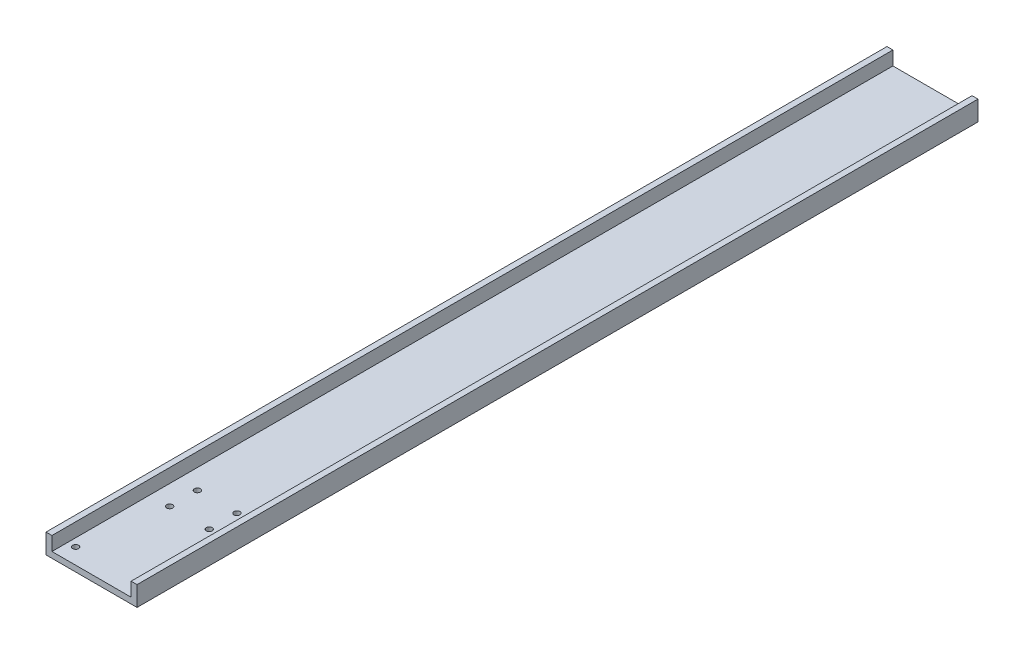
ISO-10303-21;
HEADER;
FILE_DESCRIPTION(('STEP AP214'),'2;1');
FILE_NAME('part.step','',(''),(''),'','','');
FILE_SCHEMA(('AUTOMOTIVE_DESIGN { 1 0 10303 214 1 1 1 1 }'));
ENDSEC;
DATA;
#1=APPLICATION_CONTEXT('core data for automotive mechanical design processes');
#2=APPLICATION_PROTOCOL_DEFINITION('international standard','automotive_design',2000,#1);
#3=PRODUCT_CONTEXT('',#1,'mechanical');
#4=PRODUCT('Part','Part','',(#3));
#5=PRODUCT_RELATED_PRODUCT_CATEGORY('part','',(#4));
#6=PRODUCT_DEFINITION_FORMATION('','',#4);
#7=PRODUCT_DEFINITION_CONTEXT('part definition',#1,'design');
#8=PRODUCT_DEFINITION('design','',#6,#7);
#9=PRODUCT_DEFINITION_SHAPE('','',#8);
#10=(LENGTH_UNIT() NAMED_UNIT(*) SI_UNIT(.MILLI.,.METRE.));
#11=(NAMED_UNIT(*) PLANE_ANGLE_UNIT() SI_UNIT($,.RADIAN.));
#12=(NAMED_UNIT(*) SI_UNIT($,.STERADIAN.) SOLID_ANGLE_UNIT());
#13=UNCERTAINTY_MEASURE_WITH_UNIT(LENGTH_MEASURE(1.E-05),#10,'distance_accuracy_value','');
#14=(GEOMETRIC_REPRESENTATION_CONTEXT(3) GLOBAL_UNCERTAINTY_ASSIGNED_CONTEXT((#13)) GLOBAL_UNIT_ASSIGNED_CONTEXT((#10,
#11,#12)) REPRESENTATION_CONTEXT('',''));
#15=CARTESIAN_POINT('',(0.,0.,0.));
#16=DIRECTION('',(0.,0.,1.));
#17=DIRECTION('',(1.,0.,0.));
#18=AXIS2_PLACEMENT_3D('',#15,#16,#17);
#19=CARTESIAN_POINT('',(40.,0.,425.));
#20=DIRECTION('',(0.,-1.,0.));
#21=DIRECTION('',(0.,0.,-1.));
#22=AXIS2_PLACEMENT_3D('',#19,#20,#21);
#23=PLANE('',#22);
#24=CARTESIAN_POINT('',(36.,0.,417.));
#25=DIRECTION('',(0.,-1.,0.));
#26=DIRECTION('',(0.,0.,-1.));
#27=AXIS2_PLACEMENT_3D('',#24,#25,#26);
#28=CIRCLE('',#27,1.49999999999999);
#29=CARTESIAN_POINT('',(36.,0.,415.5));
#30=VERTEX_POINT('',#29);
#31=EDGE_CURVE('E277',#30,#30,#28,.T.);
#32=ORIENTED_EDGE('',*,*,#31,.T.);
#33=EDGE_LOOP('',(#32));
#34=FACE_BOUND('',#33,.T.);
#35=CARTESIAN_POINT('',(4.,0.,417.));
#36=DIRECTION('',(0.,-1.,0.));
#37=DIRECTION('',(0.,0.,-1.));
#38=AXIS2_PLACEMENT_3D('',#35,#36,#37);
#39=CIRCLE('',#38,1.49999999999999);
#40=CARTESIAN_POINT('',(4.,0.,415.5));
#41=VERTEX_POINT('',#40);
#42=EDGE_CURVE('E279',#41,#41,#39,.T.);
#43=ORIENTED_EDGE('',*,*,#42,.T.);
#44=EDGE_LOOP('',(#43));
#45=FACE_BOUND('',#44,.T.);
#46=CARTESIAN_POINT('',(10.,0.,375.5));
#47=DIRECTION('',(0.,1.,0.));
#48=DIRECTION('',(0.,0.,1.));
#49=AXIS2_PLACEMENT_3D('',#46,#47,#48);
#50=CIRCLE('',#49,1.49999999999999);
#51=CARTESIAN_POINT('',(10.,0.,377.));
#52=VERTEX_POINT('',#51);
#53=EDGE_CURVE('E285',#52,#52,#50,.T.);
#54=ORIENTED_EDGE('',*,*,#53,.F.);
#55=EDGE_LOOP('',(#54));
#56=FACE_BOUND('',#55,.T.);
#57=DIRECTION('',(-1.,0.,0.));
#58=VECTOR('',#57,1.);
#59=CARTESIAN_POINT('',(40.,0.,0.));
#60=LINE('',#59,#58);
#61=CARTESIAN_POINT('',(40.,0.,0.));
#62=VERTEX_POINT('',#61);
#63=CARTESIAN_POINT('',(0.,0.,0.));
#64=VERTEX_POINT('',#63);
#65=EDGE_CURVE('E134',#62,#64,#60,.T.);
#66=ORIENTED_EDGE('',*,*,#65,.T.);
#67=DIRECTION('',(0.,0.,-1.));
#68=VECTOR('',#67,1.);
#69=CARTESIAN_POINT('',(0.,0.,425.));
#70=LINE('',#69,#68);
#71=CARTESIAN_POINT('',(0.,0.,425.));
#72=VERTEX_POINT('',#71);
#73=EDGE_CURVE('E42',#72,#64,#70,.T.);
#74=ORIENTED_EDGE('',*,*,#73,.F.);
#75=DIRECTION('',(-1.,0.,0.));
#76=VECTOR('',#75,1.);
#77=CARTESIAN_POINT('',(40.,0.,425.));
#78=LINE('',#77,#76);
#79=CARTESIAN_POINT('',(40.,0.,425.));
#80=VERTEX_POINT('',#79);
#81=EDGE_CURVE('E94',#80,#72,#78,.T.);
#82=ORIENTED_EDGE('',*,*,#81,.F.);
#83=DIRECTION('',(0.,0.,-1.));
#84=VECTOR('',#83,1.);
#85=CARTESIAN_POINT('',(40.,0.,425.));
#86=LINE('',#85,#84);
#87=EDGE_CURVE('E11',#80,#62,#86,.T.);
#88=ORIENTED_EDGE('',*,*,#87,.T.);
#89=EDGE_LOOP('',(#66,#74,#82,#88));
#90=FACE_BOUND('',#89,.T.);
#91=CARTESIAN_POINT('',(10.,0.,361.5));
#92=DIRECTION('',(0.,1.,0.));
#93=DIRECTION('',(0.,0.,1.));
#94=AXIS2_PLACEMENT_3D('',#91,#92,#93);
#95=CIRCLE('',#94,1.49999999999999);
#96=CARTESIAN_POINT('',(10.,0.,363.));
#97=VERTEX_POINT('',#96);
#98=EDGE_CURVE('E159',#97,#97,#95,.T.);
#99=ORIENTED_EDGE('',*,*,#98,.F.);
#100=EDGE_LOOP('',(#99));
#101=FACE_BOUND('',#100,.T.);
#102=CARTESIAN_POINT('',(30.,0.,361.5));
#103=DIRECTION('',(0.,1.,0.));
#104=DIRECTION('',(0.,0.,1.));
#105=AXIS2_PLACEMENT_3D('',#102,#103,#104);
#106=CIRCLE('',#105,1.49999999999999);
#107=CARTESIAN_POINT('',(30.,0.,363.));
#108=VERTEX_POINT('',#107);
#109=EDGE_CURVE('E160',#108,#108,#106,.T.);
#110=ORIENTED_EDGE('',*,*,#109,.F.);
#111=EDGE_LOOP('',(#110));
#112=FACE_BOUND('',#111,.T.);
#113=CARTESIAN_POINT('',(30.,0.,375.5));
#114=DIRECTION('',(0.,1.,0.));
#115=DIRECTION('',(0.,0.,1.));
#116=AXIS2_PLACEMENT_3D('',#113,#114,#115);
#117=CIRCLE('',#116,1.49999999999999);
#118=CARTESIAN_POINT('',(30.,0.,377.));
#119=VERTEX_POINT('',#118);
#120=EDGE_CURVE('E171',#119,#119,#117,.T.);
#121=ORIENTED_EDGE('',*,*,#120,.F.);
#122=EDGE_LOOP('',(#121));
#123=FACE_BOUND('',#122,.T.);
#124=ADVANCED_FACE('F32',(#34,#45,#56,#90,#101,#112,#123),#23,.F.);
#125=CARTESIAN_POINT('',(40.,6.99999999999999,425.));
#126=DIRECTION('',(1.,0.,0.));
#127=DIRECTION('',(0.,0.,-1.));
#128=AXIS2_PLACEMENT_3D('',#125,#126,#127);
#129=PLANE('',#128);
#130=DIRECTION('',(0.,-1.,0.));
#131=VECTOR('',#130,1.);
#132=CARTESIAN_POINT('',(40.,6.99999999999999,0.));
#133=LINE('',#132,#131);
#134=CARTESIAN_POINT('',(40.,6.99999999999999,0.));
#135=VERTEX_POINT('',#134);
#136=EDGE_CURVE('E131',#135,#62,#133,.T.);
#137=ORIENTED_EDGE('',*,*,#136,.T.);
#138=ORIENTED_EDGE('',*,*,#87,.F.);
#139=DIRECTION('',(0.,-1.,0.));
#140=VECTOR('',#139,1.);
#141=CARTESIAN_POINT('',(40.,6.99999999999999,425.));
#142=LINE('',#141,#140);
#143=CARTESIAN_POINT('',(40.,6.99999999999999,425.));
#144=VERTEX_POINT('',#143);
#145=EDGE_CURVE('E146',#144,#80,#142,.T.);
#146=ORIENTED_EDGE('',*,*,#145,.F.);
#147=DIRECTION('',(0.,0.,-1.));
#148=VECTOR('',#147,1.);
#149=CARTESIAN_POINT('',(40.,6.99999999999999,425.));
#150=LINE('',#149,#148);
#151=EDGE_CURVE('E127',#144,#135,#150,.T.);
#152=ORIENTED_EDGE('',*,*,#151,.T.);
#153=EDGE_LOOP('',(#137,#138,#146,#152));
#154=FACE_BOUND('',#153,.T.);
#155=ADVANCED_FACE('F34',(#154),#129,.F.);
#156=CARTESIAN_POINT('',(0.,0.,425.));
#157=DIRECTION('',(-1.,0.,0.));
#158=DIRECTION('',(0.,0.,1.));
#159=AXIS2_PLACEMENT_3D('',#156,#157,#158);
#160=PLANE('',#159);
#161=DIRECTION('',(0.,1.,0.));
#162=VECTOR('',#161,1.);
#163=CARTESIAN_POINT('',(0.,0.,0.));
#164=LINE('',#163,#162);
#165=CARTESIAN_POINT('',(0.,6.99999999999999,0.));
#166=VERTEX_POINT('',#165);
#167=EDGE_CURVE('E137',#64,#166,#164,.T.);
#168=ORIENTED_EDGE('',*,*,#167,.T.);
#169=DIRECTION('',(0.,0.,-1.));
#170=VECTOR('',#169,1.);
#171=CARTESIAN_POINT('',(0.,6.99999999999999,425.));
#172=LINE('',#171,#170);
#173=CARTESIAN_POINT('',(0.,6.99999999999999,425.));
#174=VERTEX_POINT('',#173);
#175=EDGE_CURVE('E153',#174,#166,#172,.T.);
#176=ORIENTED_EDGE('',*,*,#175,.F.);
#177=DIRECTION('',(0.,1.,0.));
#178=VECTOR('',#177,1.);
#179=CARTESIAN_POINT('',(0.,0.,425.));
#180=LINE('',#179,#178);
#181=EDGE_CURVE('E179',#72,#174,#180,.T.);
#182=ORIENTED_EDGE('',*,*,#181,.F.);
#183=ORIENTED_EDGE('',*,*,#73,.T.);
#184=EDGE_LOOP('',(#168,#176,#182,#183));
#185=FACE_BOUND('',#184,.T.);
#186=ADVANCED_FACE('F216',(#185),#160,.F.);
#187=CARTESIAN_POINT('',(0.,6.99999999999999,425.));
#188=DIRECTION('',(0.,-1.,0.));
#189=DIRECTION('',(0.,0.,-1.));
#190=AXIS2_PLACEMENT_3D('',#187,#188,#189);
#191=PLANE('',#190);
#192=DIRECTION('',(-1.,0.,0.));
#193=VECTOR('',#192,1.);
#194=CARTESIAN_POINT('',(0.,6.99999999999999,0.));
#195=LINE('',#194,#193);
#196=CARTESIAN_POINT('',(-3.,6.99999999999999,0.));
#197=VERTEX_POINT('',#196);
#198=EDGE_CURVE('E139',#166,#197,#195,.T.);
#199=ORIENTED_EDGE('',*,*,#198,.T.);
#200=DIRECTION('',(0.,0.,-1.));
#201=VECTOR('',#200,1.);
#202=CARTESIAN_POINT('',(-3.,6.99999999999999,425.));
#203=LINE('',#202,#201);
#204=CARTESIAN_POINT('',(-3.,6.99999999999999,425.));
#205=VERTEX_POINT('',#204);
#206=EDGE_CURVE('E150',#205,#197,#203,.T.);
#207=ORIENTED_EDGE('',*,*,#206,.F.);
#208=DIRECTION('',(-1.,0.,0.));
#209=VECTOR('',#208,1.);
#210=CARTESIAN_POINT('',(0.,6.99999999999999,425.));
#211=LINE('',#210,#209);
#212=EDGE_CURVE('E181',#174,#205,#211,.T.);
#213=ORIENTED_EDGE('',*,*,#212,.F.);
#214=ORIENTED_EDGE('',*,*,#175,.T.);
#215=EDGE_LOOP('',(#199,#207,#213,#214));
#216=FACE_BOUND('',#215,.T.);
#217=ADVANCED_FACE('F187',(#216),#191,.F.);
#218=CARTESIAN_POINT('',(-3.,6.99999999999999,425.));
#219=DIRECTION('',(1.,0.,0.));
#220=DIRECTION('',(0.,1.,0.));
#221=AXIS2_PLACEMENT_3D('',#218,#219,#220);
#222=PLANE('',#221);
#223=DIRECTION('',(0.,-1.,0.));
#224=VECTOR('',#223,1.);
#225=CARTESIAN_POINT('',(-3.,6.99999999999999,0.));
#226=LINE('',#225,#224);
#227=CARTESIAN_POINT('',(-3.,-3.,0.));
#228=VERTEX_POINT('',#227);
#229=EDGE_CURVE('E141',#197,#228,#226,.T.);
#230=ORIENTED_EDGE('',*,*,#229,.T.);
#231=DIRECTION('',(0.,0.,-1.));
#232=VECTOR('',#231,1.);
#233=CARTESIAN_POINT('',(-3.,-3.,425.));
#234=LINE('',#233,#232);
#235=CARTESIAN_POINT('',(-3.,-3.,425.));
#236=VERTEX_POINT('',#235);
#237=EDGE_CURVE('E122',#236,#228,#234,.T.);
#238=ORIENTED_EDGE('',*,*,#237,.F.);
#239=DIRECTION('',(0.,-1.,0.));
#240=VECTOR('',#239,1.);
#241=CARTESIAN_POINT('',(-3.,6.99999999999999,425.));
#242=LINE('',#241,#240);
#243=EDGE_CURVE('E113',#205,#236,#242,.T.);
#244=ORIENTED_EDGE('',*,*,#243,.F.);
#245=ORIENTED_EDGE('',*,*,#206,.T.);
#246=EDGE_LOOP('',(#230,#238,#244,#245));
#247=FACE_BOUND('',#246,.T.);
#248=ADVANCED_FACE('F191',(#247),#222,.F.);
#249=CARTESIAN_POINT('',(-3.,-3.,425.));
#250=DIRECTION('',(0.,1.,0.));
#251=DIRECTION('',(-1.,0.,0.));
#252=AXIS2_PLACEMENT_3D('',#249,#250,#251);
#253=PLANE('',#252);
#254=CARTESIAN_POINT('',(36.,-3.,417.));
#255=DIRECTION('',(0.,-1.,0.));
#256=DIRECTION('',(0.,0.,-1.));
#257=AXIS2_PLACEMENT_3D('',#254,#255,#256);
#258=CIRCLE('',#257,1.49999999999999);
#259=CARTESIAN_POINT('',(36.,-3.,415.5));
#260=VERTEX_POINT('',#259);
#261=EDGE_CURVE('E234',#260,#260,#258,.T.);
#262=ORIENTED_EDGE('',*,*,#261,.F.);
#263=EDGE_LOOP('',(#262));
#264=FACE_BOUND('',#263,.T.);
#265=CARTESIAN_POINT('',(4.,-3.,417.));
#266=DIRECTION('',(0.,-1.,0.));
#267=DIRECTION('',(0.,0.,-1.));
#268=AXIS2_PLACEMENT_3D('',#265,#266,#267);
#269=CIRCLE('',#268,1.49999999999999);
#270=CARTESIAN_POINT('',(4.,-3.,415.5));
#271=VERTEX_POINT('',#270);
#272=EDGE_CURVE('E238',#271,#271,#269,.T.);
#273=ORIENTED_EDGE('',*,*,#272,.F.);
#274=EDGE_LOOP('',(#273));
#275=FACE_BOUND('',#274,.T.);
#276=CARTESIAN_POINT('',(10.,-3.,375.5));
#277=DIRECTION('',(0.,1.,0.));
#278=DIRECTION('',(-1.,0.,0.));
#279=AXIS2_PLACEMENT_3D('',#276,#277,#278);
#280=CIRCLE('',#279,1.49999999999999);
#281=CARTESIAN_POINT('',(8.50000000000001,-3.,375.5));
#282=VERTEX_POINT('',#281);
#283=EDGE_CURVE('E36',#282,#282,#280,.T.);
#284=ORIENTED_EDGE('',*,*,#283,.T.);
#285=EDGE_LOOP('',(#284));
#286=FACE_BOUND('',#285,.T.);
#287=CARTESIAN_POINT('',(30.,-3.,375.5));
#288=DIRECTION('',(0.,1.,0.));
#289=DIRECTION('',(-1.,0.,0.));
#290=AXIS2_PLACEMENT_3D('',#287,#288,#289);
#291=CIRCLE('',#290,1.49999999999999);
#292=CARTESIAN_POINT('',(28.5,-3.,375.5));
#293=VERTEX_POINT('',#292);
#294=EDGE_CURVE('E166',#293,#293,#291,.T.);
#295=ORIENTED_EDGE('',*,*,#294,.T.);
#296=EDGE_LOOP('',(#295));
#297=FACE_BOUND('',#296,.T.);
#298=CARTESIAN_POINT('',(30.,-3.,361.5));
#299=DIRECTION('',(0.,1.,0.));
#300=DIRECTION('',(-1.,0.,0.));
#301=AXIS2_PLACEMENT_3D('',#298,#299,#300);
#302=CIRCLE('',#301,1.49999999999999);
#303=CARTESIAN_POINT('',(28.5,-3.,361.5));
#304=VERTEX_POINT('',#303);
#305=EDGE_CURVE('E157',#304,#304,#302,.T.);
#306=ORIENTED_EDGE('',*,*,#305,.T.);
#307=EDGE_LOOP('',(#306));
#308=FACE_BOUND('',#307,.T.);
#309=CARTESIAN_POINT('',(10.,-3.,361.5));
#310=DIRECTION('',(0.,1.,0.));
#311=DIRECTION('',(-1.,0.,0.));
#312=AXIS2_PLACEMENT_3D('',#309,#310,#311);
#313=CIRCLE('',#312,1.49999999999999);
#314=CARTESIAN_POINT('',(8.50000000000001,-3.,361.5));
#315=VERTEX_POINT('',#314);
#316=EDGE_CURVE('E135',#315,#315,#313,.T.);
#317=ORIENTED_EDGE('',*,*,#316,.T.);
#318=EDGE_LOOP('',(#317));
#319=FACE_BOUND('',#318,.T.);
#320=DIRECTION('',(1.,0.,0.));
#321=VECTOR('',#320,1.);
#322=CARTESIAN_POINT('',(-3.,-3.,0.));
#323=LINE('',#322,#321);
#324=CARTESIAN_POINT('',(43.,-3.,0.));
#325=VERTEX_POINT('',#324);
#326=EDGE_CURVE('E121',#228,#325,#323,.T.);
#327=ORIENTED_EDGE('',*,*,#326,.T.);
#328=DIRECTION('',(0.,0.,-1.));
#329=VECTOR('',#328,1.);
#330=CARTESIAN_POINT('',(43.,-3.,425.));
#331=LINE('',#330,#329);
#332=CARTESIAN_POINT('',(43.,-3.,425.));
#333=VERTEX_POINT('',#332);
#334=EDGE_CURVE('E118',#333,#325,#331,.T.);
#335=ORIENTED_EDGE('',*,*,#334,.F.);
#336=DIRECTION('',(1.,0.,0.));
#337=VECTOR('',#336,1.);
#338=CARTESIAN_POINT('',(-3.,-3.,425.));
#339=LINE('',#338,#337);
#340=EDGE_CURVE('E107',#236,#333,#339,.T.);
#341=ORIENTED_EDGE('',*,*,#340,.F.);
#342=ORIENTED_EDGE('',*,*,#237,.T.);
#343=EDGE_LOOP('',(#327,#335,#341,#342));
#344=FACE_BOUND('',#343,.T.);
#345=ADVANCED_FACE('F119',(#264,#275,#286,#297,#308,#319,#344),#253,.F.);
#346=CARTESIAN_POINT('',(43.,-3.,425.));
#347=DIRECTION('',(-1.,0.,0.));
#348=DIRECTION('',(0.,0.,1.));
#349=AXIS2_PLACEMENT_3D('',#346,#347,#348);
#350=PLANE('',#349);
#351=DIRECTION('',(0.,1.,0.));
#352=VECTOR('',#351,1.);
#353=CARTESIAN_POINT('',(43.,-3.,0.));
#354=LINE('',#353,#352);
#355=CARTESIAN_POINT('',(43.,6.99999999999999,0.));
#356=VERTEX_POINT('',#355);
#357=EDGE_CURVE('E80',#325,#356,#354,.T.);
#358=ORIENTED_EDGE('',*,*,#357,.T.);
#359=DIRECTION('',(0.,0.,-1.));
#360=VECTOR('',#359,1.);
#361=CARTESIAN_POINT('',(43.,6.99999999999999,425.));
#362=LINE('',#361,#360);
#363=CARTESIAN_POINT('',(43.,6.99999999999999,425.));
#364=VERTEX_POINT('',#363);
#365=EDGE_CURVE('E123',#364,#356,#362,.T.);
#366=ORIENTED_EDGE('',*,*,#365,.F.);
#367=DIRECTION('',(0.,1.,0.));
#368=VECTOR('',#367,1.);
#369=CARTESIAN_POINT('',(43.,-3.,425.));
#370=LINE('',#369,#368);
#371=EDGE_CURVE('E111',#333,#364,#370,.T.);
#372=ORIENTED_EDGE('',*,*,#371,.F.);
#373=ORIENTED_EDGE('',*,*,#334,.T.);
#374=EDGE_LOOP('',(#358,#366,#372,#373));
#375=FACE_BOUND('',#374,.T.);
#376=ADVANCED_FACE('F125',(#375),#350,.F.);
#377=CARTESIAN_POINT('',(43.,6.99999999999999,425.));
#378=DIRECTION('',(0.,-1.,0.));
#379=DIRECTION('',(0.,0.,-1.));
#380=AXIS2_PLACEMENT_3D('',#377,#378,#379);
#381=PLANE('',#380);
#382=DIRECTION('',(-1.,0.,0.));
#383=VECTOR('',#382,1.);
#384=CARTESIAN_POINT('',(43.,6.99999999999999,0.));
#385=LINE('',#384,#383);
#386=EDGE_CURVE('E86',#356,#135,#385,.T.);
#387=ORIENTED_EDGE('',*,*,#386,.T.);
#388=ORIENTED_EDGE('',*,*,#151,.F.);
#389=DIRECTION('',(-1.,0.,0.));
#390=VECTOR('',#389,1.);
#391=CARTESIAN_POINT('',(43.,6.99999999999999,425.));
#392=LINE('',#391,#390);
#393=EDGE_CURVE('E51',#364,#144,#392,.T.);
#394=ORIENTED_EDGE('',*,*,#393,.F.);
#395=ORIENTED_EDGE('',*,*,#365,.T.);
#396=EDGE_LOOP('',(#387,#388,#394,#395));
#397=FACE_BOUND('',#396,.T.);
#398=ADVANCED_FACE('F199',(#397),#381,.F.);
#399=CARTESIAN_POINT('',(0.,0.,425.));
#400=DIRECTION('',(0.,0.,-1.));
#401=DIRECTION('',(-1.,0.,0.));
#402=AXIS2_PLACEMENT_3D('',#399,#400,#401);
#403=PLANE('',#402);
#404=ORIENTED_EDGE('',*,*,#145,.T.);
#405=ORIENTED_EDGE('',*,*,#81,.T.);
#406=ORIENTED_EDGE('',*,*,#181,.T.);
#407=ORIENTED_EDGE('',*,*,#212,.T.);
#408=ORIENTED_EDGE('',*,*,#243,.T.);
#409=ORIENTED_EDGE('',*,*,#340,.T.);
#410=ORIENTED_EDGE('',*,*,#371,.T.);
#411=ORIENTED_EDGE('',*,*,#393,.T.);
#412=EDGE_LOOP('',(#404,#405,#406,#407,#408,#409,#410,#411));
#413=FACE_BOUND('',#412,.T.);
#414=ADVANCED_FACE('F109',(#413),#403,.F.);
#415=CARTESIAN_POINT('',(0.,0.,0.));
#416=DIRECTION('',(0.,0.,-1.));
#417=DIRECTION('',(-1.,0.,0.));
#418=AXIS2_PLACEMENT_3D('',#415,#416,#417);
#419=PLANE('',#418);
#420=ORIENTED_EDGE('',*,*,#136,.F.);
#421=ORIENTED_EDGE('',*,*,#386,.F.);
#422=ORIENTED_EDGE('',*,*,#357,.F.);
#423=ORIENTED_EDGE('',*,*,#326,.F.);
#424=ORIENTED_EDGE('',*,*,#229,.F.);
#425=ORIENTED_EDGE('',*,*,#198,.F.);
#426=ORIENTED_EDGE('',*,*,#167,.F.);
#427=ORIENTED_EDGE('',*,*,#65,.F.);
#428=EDGE_LOOP('',(#420,#421,#422,#423,#424,#425,#426,#427));
#429=FACE_BOUND('',#428,.T.);
#430=ADVANCED_FACE('F194',(#429),#419,.T.);
#431=CARTESIAN_POINT('',(10.,0.,361.5));
#432=DIRECTION('',(0.,1.,0.));
#433=DIRECTION('',(0.,0.,1.));
#434=AXIS2_PLACEMENT_3D('',#431,#432,#433);
#435=CYLINDRICAL_SURFACE('',#434,1.49999999999999);
#436=ORIENTED_EDGE('',*,*,#98,.T.);
#437=EDGE_LOOP('',(#436));
#438=FACE_BOUND('',#437,.T.);
#439=ORIENTED_EDGE('',*,*,#316,.F.);
#440=EDGE_LOOP('',(#439));
#441=FACE_BOUND('',#440,.T.);
#442=ADVANCED_FACE('F246',(#438,#441),#435,.F.);
#443=CARTESIAN_POINT('',(30.,0.,361.5));
#444=DIRECTION('',(0.,1.,0.));
#445=DIRECTION('',(0.,0.,1.));
#446=AXIS2_PLACEMENT_3D('',#443,#444,#445);
#447=CYLINDRICAL_SURFACE('',#446,1.49999999999999);
#448=ORIENTED_EDGE('',*,*,#109,.T.);
#449=EDGE_LOOP('',(#448));
#450=FACE_BOUND('',#449,.T.);
#451=ORIENTED_EDGE('',*,*,#305,.F.);
#452=EDGE_LOOP('',(#451));
#453=FACE_BOUND('',#452,.T.);
#454=ADVANCED_FACE('F248',(#450,#453),#447,.F.);
#455=CARTESIAN_POINT('',(30.,0.,375.5));
#456=DIRECTION('',(0.,1.,0.));
#457=DIRECTION('',(0.,0.,1.));
#458=AXIS2_PLACEMENT_3D('',#455,#456,#457);
#459=CYLINDRICAL_SURFACE('',#458,1.49999999999999);
#460=ORIENTED_EDGE('',*,*,#120,.T.);
#461=EDGE_LOOP('',(#460));
#462=FACE_BOUND('',#461,.T.);
#463=ORIENTED_EDGE('',*,*,#294,.F.);
#464=EDGE_LOOP('',(#463));
#465=FACE_BOUND('',#464,.T.);
#466=ADVANCED_FACE('F255',(#462,#465),#459,.F.);
#467=CARTESIAN_POINT('',(10.,0.,375.5));
#468=DIRECTION('',(0.,1.,0.));
#469=DIRECTION('',(0.,0.,1.));
#470=AXIS2_PLACEMENT_3D('',#467,#468,#469);
#471=CYLINDRICAL_SURFACE('',#470,1.49999999999999);
#472=ORIENTED_EDGE('',*,*,#53,.T.);
#473=EDGE_LOOP('',(#472));
#474=FACE_BOUND('',#473,.T.);
#475=ORIENTED_EDGE('',*,*,#283,.F.);
#476=EDGE_LOOP('',(#475));
#477=FACE_BOUND('',#476,.T.);
#478=ADVANCED_FACE('F261',(#474,#477),#471,.F.);
#479=CARTESIAN_POINT('',(4.,-3.,417.));
#480=DIRECTION('',(0.,-1.,0.));
#481=DIRECTION('',(0.,0.,-1.));
#482=AXIS2_PLACEMENT_3D('',#479,#480,#481);
#483=CYLINDRICAL_SURFACE('',#482,1.49999999999999);
#484=ORIENTED_EDGE('',*,*,#272,.T.);
#485=EDGE_LOOP('',(#484));
#486=FACE_BOUND('',#485,.T.);
#487=ORIENTED_EDGE('',*,*,#42,.F.);
#488=EDGE_LOOP('',(#487));
#489=FACE_BOUND('',#488,.T.);
#490=ADVANCED_FACE('F265',(#486,#489),#483,.F.);
#491=CARTESIAN_POINT('',(36.,-3.,417.));
#492=DIRECTION('',(0.,-1.,0.));
#493=DIRECTION('',(0.,0.,-1.));
#494=AXIS2_PLACEMENT_3D('',#491,#492,#493);
#495=CYLINDRICAL_SURFACE('',#494,1.49999999999999);
#496=ORIENTED_EDGE('',*,*,#261,.T.);
#497=EDGE_LOOP('',(#496));
#498=FACE_BOUND('',#497,.T.);
#499=ORIENTED_EDGE('',*,*,#31,.F.);
#500=EDGE_LOOP('',(#499));
#501=FACE_BOUND('',#500,.T.);
#502=ADVANCED_FACE('F269',(#498,#501),#495,.F.);
#503=CLOSED_SHELL('',(#124,#155,#186,#217,#248,#345,#376,#398,#414,#430,#442,#454,#466,#478,
#490,#502));
#504=MANIFOLD_SOLID_BREP('B2',#503);
#505=ADVANCED_BREP_SHAPE_REPRESENTATION('',(#18,#504),#14);
#506=SHAPE_DEFINITION_REPRESENTATION(#9,#505);
ENDSEC;
END-ISO-10303-21;
